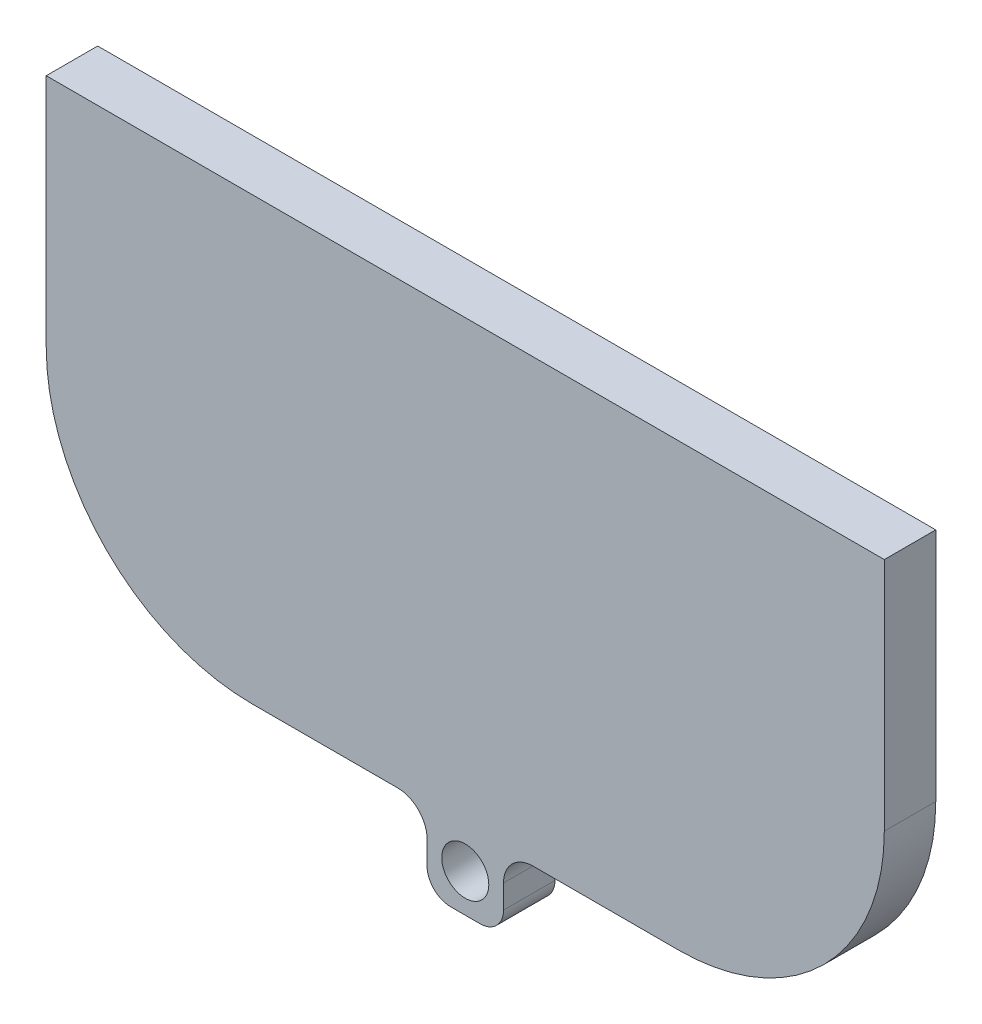
ISO-10303-21;
HEADER;
FILE_DESCRIPTION(('STEP AP214'),'2;1');
FILE_NAME('part.step','',(''),(''),'','','');
FILE_SCHEMA(('AUTOMOTIVE_DESIGN { 1 0 10303 214 1 1 1 1 }'));
ENDSEC;
DATA;
#1=APPLICATION_CONTEXT('core data for automotive mechanical design processes');
#2=APPLICATION_PROTOCOL_DEFINITION('international standard','automotive_design',2000,#1);
#3=PRODUCT_CONTEXT('',#1,'mechanical');
#4=PRODUCT('Part','Part','',(#3));
#5=PRODUCT_RELATED_PRODUCT_CATEGORY('part','',(#4));
#6=PRODUCT_DEFINITION_FORMATION('','',#4);
#7=PRODUCT_DEFINITION_CONTEXT('part definition',#1,'design');
#8=PRODUCT_DEFINITION('design','',#6,#7);
#9=PRODUCT_DEFINITION_SHAPE('','',#8);
#10=(LENGTH_UNIT() NAMED_UNIT(*) SI_UNIT(.MILLI.,.METRE.));
#11=(NAMED_UNIT(*) PLANE_ANGLE_UNIT() SI_UNIT($,.RADIAN.));
#12=(NAMED_UNIT(*) SI_UNIT($,.STERADIAN.) SOLID_ANGLE_UNIT());
#13=UNCERTAINTY_MEASURE_WITH_UNIT(LENGTH_MEASURE(1.E-05),#10,'distance_accuracy_value','');
#14=(GEOMETRIC_REPRESENTATION_CONTEXT(3) GLOBAL_UNCERTAINTY_ASSIGNED_CONTEXT((#13)) GLOBAL_UNIT_ASSIGNED_CONTEXT((#10,
#11,#12)) REPRESENTATION_CONTEXT('',''));
#15=CARTESIAN_POINT('',(0.,0.,0.));
#16=DIRECTION('',(0.,0.,1.));
#17=DIRECTION('',(1.,0.,0.));
#18=AXIS2_PLACEMENT_3D('',#15,#16,#17);
#19=CARTESIAN_POINT('',(-14.5,-30.,3.5));
#20=DIRECTION('',(0.,1.,0.));
#21=DIRECTION('',(-1.,0.,0.));
#22=AXIS2_PLACEMENT_3D('',#19,#20,#21);
#23=PLANE('',#22);
#24=DIRECTION('',(1.,0.,0.));
#25=VECTOR('',#24,1.);
#26=CARTESIAN_POINT('',(-14.5,-30.,3.5));
#27=LINE('',#26,#25);
#28=CARTESIAN_POINT('',(4.6,-30.,3.5));
#29=VERTEX_POINT('',#28);
#30=CARTESIAN_POINT('',(14.5,-30.,3.5));
#31=VERTEX_POINT('',#30);
#32=EDGE_CURVE('E232',#29,#31,#27,.T.);
#33=ORIENTED_EDGE('',*,*,#32,.F.);
#34=DIRECTION('',(0.,0.,1.));
#35=VECTOR('',#34,1.);
#36=CARTESIAN_POINT('',(4.6,-30.,0.));
#37=LINE('',#36,#35);
#38=CARTESIAN_POINT('',(4.6,-30.,0.));
#39=VERTEX_POINT('',#38);
#40=EDGE_CURVE('E82',#29,#39,#37,.F.);
#41=ORIENTED_EDGE('',*,*,#40,.T.);
#42=DIRECTION('',(1.,0.,0.));
#43=VECTOR('',#42,1.);
#44=CARTESIAN_POINT('',(-14.5,-30.,0.));
#45=LINE('',#44,#43);
#46=CARTESIAN_POINT('',(14.5,-30.,0.));
#47=VERTEX_POINT('',#46);
#48=EDGE_CURVE('E253',#39,#47,#45,.T.);
#49=ORIENTED_EDGE('',*,*,#48,.T.);
#50=DIRECTION('',(0.,0.,-1.));
#51=VECTOR('',#50,1.);
#52=CARTESIAN_POINT('',(14.5,-30.,3.5));
#53=LINE('',#52,#51);
#54=EDGE_CURVE('E263',#31,#47,#53,.T.);
#55=ORIENTED_EDGE('',*,*,#54,.F.);
#56=EDGE_LOOP('',(#33,#41,#49,#55));
#57=FACE_BOUND('',#56,.T.);
#58=ADVANCED_FACE('F60',(#57),#23,.F.);
#59=CARTESIAN_POINT('',(28.5,-16.,3.5));
#60=DIRECTION('',(-1.,0.,0.));
#61=DIRECTION('',(0.,-1.,0.));
#62=AXIS2_PLACEMENT_3D('',#59,#60,#61);
#63=PLANE('',#62);
#64=DIRECTION('',(0.,1.,0.));
#65=VECTOR('',#64,1.);
#66=CARTESIAN_POINT('',(28.5,-16.,0.));
#67=LINE('',#66,#65);
#68=CARTESIAN_POINT('',(28.5,-16.,0.));
#69=VERTEX_POINT('',#68);
#70=CARTESIAN_POINT('',(28.5,0.,0.));
#71=VERTEX_POINT('',#70);
#72=EDGE_CURVE('E218',#69,#71,#67,.T.);
#73=ORIENTED_EDGE('',*,*,#72,.T.);
#74=DIRECTION('',(0.,0.,-1.));
#75=VECTOR('',#74,1.);
#76=CARTESIAN_POINT('',(28.5,0.,3.5));
#77=LINE('',#76,#75);
#78=CARTESIAN_POINT('',(28.5,0.,3.5));
#79=VERTEX_POINT('',#78);
#80=EDGE_CURVE('E279',#79,#71,#77,.T.);
#81=ORIENTED_EDGE('',*,*,#80,.F.);
#82=DIRECTION('',(0.,1.,0.));
#83=VECTOR('',#82,1.);
#84=CARTESIAN_POINT('',(28.5,-16.,3.5));
#85=LINE('',#84,#83);
#86=CARTESIAN_POINT('',(28.5,-16.,3.5));
#87=VERTEX_POINT('',#86);
#88=EDGE_CURVE('E219',#87,#79,#85,.T.);
#89=ORIENTED_EDGE('',*,*,#88,.F.);
#90=DIRECTION('',(0.,0.,-1.));
#91=VECTOR('',#90,1.);
#92=CARTESIAN_POINT('',(28.5,-16.,3.5));
#93=LINE('',#92,#91);
#94=EDGE_CURVE('E240',#87,#69,#93,.T.);
#95=ORIENTED_EDGE('',*,*,#94,.T.);
#96=EDGE_LOOP('',(#73,#81,#89,#95));
#97=FACE_BOUND('',#96,.T.);
#98=ADVANCED_FACE('F333',(#97),#63,.F.);
#99=CARTESIAN_POINT('',(-24.5,0.,3.5));
#100=DIRECTION('',(0.,-1.,0.));
#101=DIRECTION('',(0.,0.,-1.));
#102=AXIS2_PLACEMENT_3D('',#99,#100,#101);
#103=PLANE('',#102);
#104=DIRECTION('',(-1.,0.,0.));
#105=VECTOR('',#104,1.);
#106=CARTESIAN_POINT('',(-24.5,0.,0.));
#107=LINE('',#106,#105);
#108=CARTESIAN_POINT('',(-28.5,0.,0.));
#109=VERTEX_POINT('',#108);
#110=EDGE_CURVE('E244',#71,#109,#107,.T.);
#111=ORIENTED_EDGE('',*,*,#110,.T.);
#112=DIRECTION('',(0.,0.,-1.));
#113=VECTOR('',#112,1.);
#114=CARTESIAN_POINT('',(-28.5,0.,3.5));
#115=LINE('',#114,#113);
#116=CARTESIAN_POINT('',(-28.5,0.,3.5));
#117=VERTEX_POINT('',#116);
#118=EDGE_CURVE('E275',#117,#109,#115,.T.);
#119=ORIENTED_EDGE('',*,*,#118,.F.);
#120=DIRECTION('',(-1.,0.,0.));
#121=VECTOR('',#120,1.);
#122=CARTESIAN_POINT('',(28.5,0.,3.5));
#123=LINE('',#122,#121);
#124=EDGE_CURVE('E222',#79,#117,#123,.T.);
#125=ORIENTED_EDGE('',*,*,#124,.F.);
#126=ORIENTED_EDGE('',*,*,#80,.T.);
#127=EDGE_LOOP('',(#111,#119,#125,#126));
#128=FACE_BOUND('',#127,.T.);
#129=ADVANCED_FACE('F335',(#128),#103,.F.);
#130=CARTESIAN_POINT('',(-28.5,0.,3.5));
#131=DIRECTION('',(1.,0.,0.));
#132=DIRECTION('',(0.,0.,-1.));
#133=AXIS2_PLACEMENT_3D('',#130,#131,#132);
#134=PLANE('',#133);
#135=DIRECTION('',(0.,-1.,0.));
#136=VECTOR('',#135,1.);
#137=CARTESIAN_POINT('',(-28.5,0.,0.));
#138=LINE('',#137,#136);
#139=CARTESIAN_POINT('',(-28.5,-16.,0.));
#140=VERTEX_POINT('',#139);
#141=EDGE_CURVE('E247',#109,#140,#138,.T.);
#142=ORIENTED_EDGE('',*,*,#141,.T.);
#143=DIRECTION('',(0.,0.,-1.));
#144=VECTOR('',#143,1.);
#145=CARTESIAN_POINT('',(-28.5,-16.,3.5));
#146=LINE('',#145,#144);
#147=CARTESIAN_POINT('',(-28.5,-16.,3.5));
#148=VERTEX_POINT('',#147);
#149=EDGE_CURVE('E271',#148,#140,#146,.T.);
#150=ORIENTED_EDGE('',*,*,#149,.F.);
#151=DIRECTION('',(0.,-1.,0.));
#152=VECTOR('',#151,1.);
#153=CARTESIAN_POINT('',(-28.5,0.,3.5));
#154=LINE('',#153,#152);
#155=EDGE_CURVE('E226',#117,#148,#154,.T.);
#156=ORIENTED_EDGE('',*,*,#155,.F.);
#157=ORIENTED_EDGE('',*,*,#118,.T.);
#158=EDGE_LOOP('',(#142,#150,#156,#157));
#159=FACE_BOUND('',#158,.T.);
#160=ADVANCED_FACE('F340',(#159),#134,.F.);
#161=CARTESIAN_POINT('',(-14.5,-16.,3.5));
#162=DIRECTION('',(0.,0.,-1.));
#163=DIRECTION('',(-1.,0.,0.));
#164=AXIS2_PLACEMENT_3D('',#161,#162,#163);
#165=CYLINDRICAL_SURFACE('',#164,14.);
#166=CARTESIAN_POINT('',(-14.5,-16.,0.));
#167=DIRECTION('',(0.,0.,1.));
#168=DIRECTION('',(1.,0.,0.));
#169=AXIS2_PLACEMENT_3D('',#166,#167,#168);
#170=CIRCLE('',#169,14.);
#171=CARTESIAN_POINT('',(-14.5,-30.,0.));
#172=VERTEX_POINT('',#171);
#173=EDGE_CURVE('E250',#140,#172,#170,.T.);
#174=ORIENTED_EDGE('',*,*,#173,.T.);
#175=DIRECTION('',(0.,0.,-1.));
#176=VECTOR('',#175,1.);
#177=CARTESIAN_POINT('',(-14.5,-30.,3.5));
#178=LINE('',#177,#176);
#179=CARTESIAN_POINT('',(-14.5,-30.,3.5));
#180=VERTEX_POINT('',#179);
#181=EDGE_CURVE('E267',#180,#172,#178,.T.);
#182=ORIENTED_EDGE('',*,*,#181,.F.);
#183=CARTESIAN_POINT('',(-14.5,-16.,3.5));
#184=DIRECTION('',(0.,0.,1.));
#185=DIRECTION('',(1.,0.,0.));
#186=AXIS2_PLACEMENT_3D('',#183,#184,#185);
#187=CIRCLE('',#186,14.);
#188=EDGE_CURVE('E229',#148,#180,#187,.T.);
#189=ORIENTED_EDGE('',*,*,#188,.F.);
#190=ORIENTED_EDGE('',*,*,#149,.T.);
#191=EDGE_LOOP('',(#174,#182,#189,#190));
#192=FACE_BOUND('',#191,.T.);
#193=ADVANCED_FACE('F345',(#192),#165,.T.);
#194=CARTESIAN_POINT('',(-4.6,-30.,0.));
#195=VERTEX_POINT('',#194);
#196=EDGE_CURVE('E254',#172,#195,#45,.T.);
#197=ORIENTED_EDGE('',*,*,#196,.T.);
#198=DIRECTION('',(0.,0.,1.));
#199=VECTOR('',#198,1.);
#200=CARTESIAN_POINT('',(-4.6,-30.,3.5));
#201=LINE('',#200,#199);
#202=CARTESIAN_POINT('',(-4.6,-30.,3.5));
#203=VERTEX_POINT('',#202);
#204=EDGE_CURVE('E283',#195,#203,#201,.T.);
#205=ORIENTED_EDGE('',*,*,#204,.T.);
#206=EDGE_CURVE('E233',#180,#203,#27,.T.);
#207=ORIENTED_EDGE('',*,*,#206,.F.);
#208=ORIENTED_EDGE('',*,*,#181,.T.);
#209=EDGE_LOOP('',(#197,#205,#207,#208));
#210=FACE_BOUND('',#209,.T.);
#211=ADVANCED_FACE('F349',(#210),#23,.F.);
#212=CARTESIAN_POINT('',(14.5,-16.,3.5));
#213=DIRECTION('',(0.,0.,-1.));
#214=DIRECTION('',(-1.,0.,0.));
#215=AXIS2_PLACEMENT_3D('',#212,#213,#214);
#216=CYLINDRICAL_SURFACE('',#215,14.);
#217=CARTESIAN_POINT('',(14.5,-16.,0.));
#218=DIRECTION('',(0.,0.,1.));
#219=DIRECTION('',(1.,0.,0.));
#220=AXIS2_PLACEMENT_3D('',#217,#218,#219);
#221=CIRCLE('',#220,14.);
#222=EDGE_CURVE('E223',#47,#69,#221,.T.);
#223=ORIENTED_EDGE('',*,*,#222,.T.);
#224=ORIENTED_EDGE('',*,*,#94,.F.);
#225=CARTESIAN_POINT('',(14.5,-16.,3.5));
#226=DIRECTION('',(0.,0.,1.));
#227=DIRECTION('',(1.,0.,0.));
#228=AXIS2_PLACEMENT_3D('',#225,#226,#227);
#229=CIRCLE('',#228,14.);
#230=EDGE_CURVE('E237',#31,#87,#229,.T.);
#231=ORIENTED_EDGE('',*,*,#230,.F.);
#232=ORIENTED_EDGE('',*,*,#54,.T.);
#233=EDGE_LOOP('',(#223,#224,#231,#232));
#234=FACE_BOUND('',#233,.T.);
#235=ADVANCED_FACE('F327',(#234),#216,.T.);
#236=CARTESIAN_POINT('',(-14.5,-16.,3.5));
#237=DIRECTION('',(0.,0.,1.));
#238=DIRECTION('',(1.,0.,0.));
#239=AXIS2_PLACEMENT_3D('',#236,#237,#238);
#240=PLANE('',#239);
#241=ORIENTED_EDGE('',*,*,#88,.T.);
#242=ORIENTED_EDGE('',*,*,#124,.T.);
#243=ORIENTED_EDGE('',*,*,#155,.T.);
#244=ORIENTED_EDGE('',*,*,#188,.T.);
#245=ORIENTED_EDGE('',*,*,#206,.T.);
#246=CARTESIAN_POINT('',(-4.6,-32.,3.5));
#247=DIRECTION('',(0.,0.,1.));
#248=DIRECTION('',(1.,0.,0.));
#249=AXIS2_PLACEMENT_3D('',#246,#247,#248);
#250=CIRCLE('',#249,2.);
#251=CARTESIAN_POINT('',(-2.6,-32.,3.5));
#252=VERTEX_POINT('',#251);
#253=EDGE_CURVE('E294',#203,#252,#250,.F.);
#254=ORIENTED_EDGE('',*,*,#253,.T.);
#255=DIRECTION('',(0.,-1.,0.));
#256=VECTOR('',#255,1.);
#257=CARTESIAN_POINT('',(-2.6,-30.,3.5));
#258=LINE('',#257,#256);
#259=CARTESIAN_POINT('',(-2.6,-33.6,3.5));
#260=VERTEX_POINT('',#259);
#261=EDGE_CURVE('E169',#252,#260,#258,.T.);
#262=ORIENTED_EDGE('',*,*,#261,.T.);
#263=CARTESIAN_POINT('',(-0.999999999999999,-33.6,3.5));
#264=DIRECTION('',(0.,0.,-1.));
#265=DIRECTION('',(-1.,0.,0.));
#266=AXIS2_PLACEMENT_3D('',#263,#264,#265);
#267=CIRCLE('',#266,1.6);
#268=CARTESIAN_POINT('',(-0.999999999999999,-35.2,3.5));
#269=VERTEX_POINT('',#268);
#270=EDGE_CURVE('E198',#269,#260,#267,.T.);
#271=ORIENTED_EDGE('',*,*,#270,.F.);
#272=DIRECTION('',(-1.,0.,0.));
#273=VECTOR('',#272,1.);
#274=CARTESIAN_POINT('',(1.,-35.2,3.5));
#275=LINE('',#274,#273);
#276=CARTESIAN_POINT('',(1.,-35.2,3.5));
#277=VERTEX_POINT('',#276);
#278=EDGE_CURVE('E180',#277,#269,#275,.T.);
#279=ORIENTED_EDGE('',*,*,#278,.F.);
#280=CARTESIAN_POINT('',(1.,-33.6,3.5));
#281=DIRECTION('',(0.,0.,1.));
#282=DIRECTION('',(1.,0.,0.));
#283=AXIS2_PLACEMENT_3D('',#280,#281,#282);
#284=CIRCLE('',#283,1.6);
#285=CARTESIAN_POINT('',(2.6,-33.6,3.5));
#286=VERTEX_POINT('',#285);
#287=EDGE_CURVE('E170',#277,#286,#284,.T.);
#288=ORIENTED_EDGE('',*,*,#287,.T.);
#289=DIRECTION('',(0.,-1.,0.));
#290=VECTOR('',#289,1.);
#291=CARTESIAN_POINT('',(2.6,-30.,3.5));
#292=LINE('',#291,#290);
#293=CARTESIAN_POINT('',(2.6,-32.,3.5));
#294=VERTEX_POINT('',#293);
#295=EDGE_CURVE('E160',#294,#286,#292,.T.);
#296=ORIENTED_EDGE('',*,*,#295,.F.);
#297=CARTESIAN_POINT('',(4.6,-32.,3.5));
#298=DIRECTION('',(0.,0.,1.));
#299=DIRECTION('',(1.,0.,0.));
#300=AXIS2_PLACEMENT_3D('',#297,#298,#299);
#301=CIRCLE('',#300,2.);
#302=EDGE_CURVE('E69',#294,#29,#301,.F.);
#303=ORIENTED_EDGE('',*,*,#302,.T.);
#304=ORIENTED_EDGE('',*,*,#32,.T.);
#305=ORIENTED_EDGE('',*,*,#230,.T.);
#306=EDGE_LOOP('',(#241,#242,#243,#244,#245,#254,#262,#271,#279,#288,#296,#303,#304,#305));
#307=FACE_BOUND('',#306,.T.);
#308=CARTESIAN_POINT('',(0.,-32.6,3.5));
#309=DIRECTION('',(0.,0.,1.));
#310=DIRECTION('',(1.,0.,0.));
#311=AXIS2_PLACEMENT_3D('',#308,#309,#310);
#312=CIRCLE('',#311,1.59999999999999);
#313=CARTESIAN_POINT('',(1.59999999999999,-32.6,3.5));
#314=VERTEX_POINT('',#313);
#315=EDGE_CURVE('E189',#314,#314,#312,.T.);
#316=ORIENTED_EDGE('',*,*,#315,.F.);
#317=EDGE_LOOP('',(#316));
#318=FACE_BOUND('',#317,.T.);
#319=ADVANCED_FACE('F184',(#307,#318),#240,.T.);
#320=CARTESIAN_POINT('',(-14.5,-16.,0.));
#321=DIRECTION('',(0.,0.,1.));
#322=DIRECTION('',(1.,0.,0.));
#323=AXIS2_PLACEMENT_3D('',#320,#321,#322);
#324=PLANE('',#323);
#325=ORIENTED_EDGE('',*,*,#72,.F.);
#326=ORIENTED_EDGE('',*,*,#222,.F.);
#327=ORIENTED_EDGE('',*,*,#48,.F.);
#328=CARTESIAN_POINT('',(4.6,-32.,0.));
#329=DIRECTION('',(0.,0.,1.));
#330=DIRECTION('',(1.,0.,0.));
#331=AXIS2_PLACEMENT_3D('',#328,#329,#330);
#332=CIRCLE('',#331,2.);
#333=CARTESIAN_POINT('',(2.6,-32.,0.));
#334=VERTEX_POINT('',#333);
#335=EDGE_CURVE('E12',#39,#334,#332,.T.);
#336=ORIENTED_EDGE('',*,*,#335,.T.);
#337=DIRECTION('',(0.,1.,0.));
#338=VECTOR('',#337,1.);
#339=CARTESIAN_POINT('',(2.6,-30.,0.));
#340=LINE('',#339,#338);
#341=CARTESIAN_POINT('',(2.6,-33.6,0.));
#342=VERTEX_POINT('',#341);
#343=EDGE_CURVE('E207',#342,#334,#340,.T.);
#344=ORIENTED_EDGE('',*,*,#343,.F.);
#345=CARTESIAN_POINT('',(1.,-33.6,0.));
#346=DIRECTION('',(0.,0.,1.));
#347=DIRECTION('',(1.,0.,0.));
#348=AXIS2_PLACEMENT_3D('',#345,#346,#347);
#349=CIRCLE('',#348,1.6);
#350=CARTESIAN_POINT('',(1.,-35.2,0.));
#351=VERTEX_POINT('',#350);
#352=EDGE_CURVE('E177',#342,#351,#349,.F.);
#353=ORIENTED_EDGE('',*,*,#352,.T.);
#354=DIRECTION('',(1.,0.,0.));
#355=VECTOR('',#354,1.);
#356=CARTESIAN_POINT('',(1.,-35.2,0.));
#357=LINE('',#356,#355);
#358=CARTESIAN_POINT('',(-0.999999999999999,-35.2,0.));
#359=VERTEX_POINT('',#358);
#360=EDGE_CURVE('E304',#359,#351,#357,.T.);
#361=ORIENTED_EDGE('',*,*,#360,.F.);
#362=CARTESIAN_POINT('',(-0.999999999999999,-33.6,0.));
#363=DIRECTION('',(0.,0.,1.));
#364=DIRECTION('',(1.,0.,0.));
#365=AXIS2_PLACEMENT_3D('',#362,#363,#364);
#366=CIRCLE('',#365,1.6);
#367=CARTESIAN_POINT('',(-2.6,-33.6,0.));
#368=VERTEX_POINT('',#367);
#369=EDGE_CURVE('E307',#368,#359,#366,.T.);
#370=ORIENTED_EDGE('',*,*,#369,.F.);
#371=DIRECTION('',(0.,1.,0.));
#372=VECTOR('',#371,1.);
#373=CARTESIAN_POINT('',(-2.6,-30.,0.));
#374=LINE('',#373,#372);
#375=CARTESIAN_POINT('',(-2.6,-32.,0.));
#376=VERTEX_POINT('',#375);
#377=EDGE_CURVE('E311',#368,#376,#374,.T.);
#378=ORIENTED_EDGE('',*,*,#377,.T.);
#379=CARTESIAN_POINT('',(-4.6,-32.,0.));
#380=DIRECTION('',(0.,0.,1.));
#381=DIRECTION('',(1.,0.,0.));
#382=AXIS2_PLACEMENT_3D('',#379,#380,#381);
#383=CIRCLE('',#382,2.);
#384=EDGE_CURVE('E297',#376,#195,#383,.T.);
#385=ORIENTED_EDGE('',*,*,#384,.T.);
#386=ORIENTED_EDGE('',*,*,#196,.F.);
#387=ORIENTED_EDGE('',*,*,#173,.F.);
#388=ORIENTED_EDGE('',*,*,#141,.F.);
#389=ORIENTED_EDGE('',*,*,#110,.F.);
#390=EDGE_LOOP('',(#325,#326,#327,#336,#344,#353,#361,#370,#378,#385,#386,#387,#388,#389));
#391=FACE_BOUND('',#390,.T.);
#392=CARTESIAN_POINT('',(0.,-32.6,0.));
#393=DIRECTION('',(0.,0.,1.));
#394=DIRECTION('',(1.,0.,0.));
#395=AXIS2_PLACEMENT_3D('',#392,#393,#394);
#396=CIRCLE('',#395,1.59999999999999);
#397=CARTESIAN_POINT('',(1.59999999999999,-32.6,0.));
#398=VERTEX_POINT('',#397);
#399=EDGE_CURVE('E214',#398,#398,#396,.F.);
#400=ORIENTED_EDGE('',*,*,#399,.F.);
#401=EDGE_LOOP('',(#400));
#402=FACE_BOUND('',#401,.T.);
#403=ADVANCED_FACE('F321',(#391,#402),#324,.F.);
#404=CARTESIAN_POINT('',(2.6,-30.,-7.35391052434009));
#405=DIRECTION('',(-1.,0.,0.));
#406=DIRECTION('',(0.,-1.,0.));
#407=AXIS2_PLACEMENT_3D('',#404,#405,#406);
#408=PLANE('',#407);
#409=ORIENTED_EDGE('',*,*,#343,.T.);
#410=DIRECTION('',(0.,0.,1.));
#411=VECTOR('',#410,1.);
#412=CARTESIAN_POINT('',(2.6,-32.,3.5));
#413=LINE('',#412,#411);
#414=EDGE_CURVE('E166',#334,#294,#413,.T.);
#415=ORIENTED_EDGE('',*,*,#414,.T.);
#416=ORIENTED_EDGE('',*,*,#295,.T.);
#417=DIRECTION('',(0.,0.,1.));
#418=VECTOR('',#417,1.);
#419=CARTESIAN_POINT('',(2.6,-33.6,-7.35391052434009));
#420=LINE('',#419,#418);
#421=EDGE_CURVE('E164',#342,#286,#420,.T.);
#422=ORIENTED_EDGE('',*,*,#421,.F.);
#423=EDGE_LOOP('',(#409,#415,#416,#422));
#424=FACE_BOUND('',#423,.T.);
#425=ADVANCED_FACE('F163',(#424),#408,.F.);
#426=CARTESIAN_POINT('',(-2.6,-30.,-7.35391052434009));
#427=DIRECTION('',(-1.,0.,0.));
#428=DIRECTION('',(0.,-1.,0.));
#429=AXIS2_PLACEMENT_3D('',#426,#427,#428);
#430=PLANE('',#429);
#431=ORIENTED_EDGE('',*,*,#261,.F.);
#432=DIRECTION('',(0.,0.,1.));
#433=VECTOR('',#432,1.);
#434=CARTESIAN_POINT('',(-2.6,-32.,-7.35391052434009));
#435=LINE('',#434,#433);
#436=EDGE_CURVE('E287',#252,#376,#435,.F.);
#437=ORIENTED_EDGE('',*,*,#436,.T.);
#438=ORIENTED_EDGE('',*,*,#377,.F.);
#439=DIRECTION('',(0.,0.,1.));
#440=VECTOR('',#439,1.);
#441=CARTESIAN_POINT('',(-2.6,-33.6,-7.35391052434009));
#442=LINE('',#441,#440);
#443=EDGE_CURVE('E179',#368,#260,#442,.T.);
#444=ORIENTED_EDGE('',*,*,#443,.T.);
#445=EDGE_LOOP('',(#431,#437,#438,#444));
#446=FACE_BOUND('',#445,.T.);
#447=ADVANCED_FACE('F357',(#446),#430,.T.);
#448=CARTESIAN_POINT('',(-0.999999999999999,-33.6,-7.35391052434009));
#449=DIRECTION('',(0.,0.,1.));
#450=DIRECTION('',(1.,0.,0.));
#451=AXIS2_PLACEMENT_3D('',#448,#449,#450);
#452=CYLINDRICAL_SURFACE('',#451,1.6);
#453=ORIENTED_EDGE('',*,*,#443,.F.);
#454=ORIENTED_EDGE('',*,*,#369,.T.);
#455=DIRECTION('',(0.,0.,1.));
#456=VECTOR('',#455,1.);
#457=CARTESIAN_POINT('',(-0.999999999999999,-35.2,-7.35391052434009));
#458=LINE('',#457,#456);
#459=EDGE_CURVE('E208',#359,#269,#458,.T.);
#460=ORIENTED_EDGE('',*,*,#459,.T.);
#461=ORIENTED_EDGE('',*,*,#270,.T.);
#462=EDGE_LOOP('',(#453,#454,#460,#461));
#463=FACE_BOUND('',#462,.T.);
#464=ADVANCED_FACE('F361',(#463),#452,.T.);
#465=CARTESIAN_POINT('',(1.,-35.2,-7.35391052434009));
#466=DIRECTION('',(0.,1.,0.));
#467=DIRECTION('',(0.,0.,1.));
#468=AXIS2_PLACEMENT_3D('',#465,#466,#467);
#469=PLANE('',#468);
#470=ORIENTED_EDGE('',*,*,#459,.F.);
#471=ORIENTED_EDGE('',*,*,#360,.T.);
#472=DIRECTION('',(0.,0.,1.));
#473=VECTOR('',#472,1.);
#474=CARTESIAN_POINT('',(1.,-35.2,-7.35391052434009));
#475=LINE('',#474,#473);
#476=EDGE_CURVE('E204',#351,#277,#475,.T.);
#477=ORIENTED_EDGE('',*,*,#476,.T.);
#478=ORIENTED_EDGE('',*,*,#278,.T.);
#479=EDGE_LOOP('',(#470,#471,#477,#478));
#480=FACE_BOUND('',#479,.T.);
#481=ADVANCED_FACE('F364',(#480),#469,.F.);
#482=CARTESIAN_POINT('',(1.,-33.6,-7.35391052434009));
#483=DIRECTION('',(0.,0.,1.));
#484=DIRECTION('',(1.,0.,0.));
#485=AXIS2_PLACEMENT_3D('',#482,#483,#484);
#486=CYLINDRICAL_SURFACE('',#485,1.6);
#487=ORIENTED_EDGE('',*,*,#352,.F.);
#488=ORIENTED_EDGE('',*,*,#421,.T.);
#489=ORIENTED_EDGE('',*,*,#287,.F.);
#490=ORIENTED_EDGE('',*,*,#476,.F.);
#491=EDGE_LOOP('',(#487,#488,#489,#490));
#492=FACE_BOUND('',#491,.T.);
#493=ADVANCED_FACE('F175',(#492),#486,.T.);
#494=CARTESIAN_POINT('',(0.,-32.6,-7.35391052434009));
#495=DIRECTION('',(0.,0.,1.));
#496=DIRECTION('',(1.,0.,0.));
#497=AXIS2_PLACEMENT_3D('',#494,#495,#496);
#498=CYLINDRICAL_SURFACE('',#497,1.59999999999999);
#499=ORIENTED_EDGE('',*,*,#399,.T.);
#500=EDGE_LOOP('',(#499));
#501=FACE_BOUND('',#500,.T.);
#502=ORIENTED_EDGE('',*,*,#315,.T.);
#503=EDGE_LOOP('',(#502));
#504=FACE_BOUND('',#503,.T.);
#505=ADVANCED_FACE('F371',(#501,#504),#498,.F.);
#506=CARTESIAN_POINT('',(-4.6,-32.,3.5));
#507=DIRECTION('',(0.,0.,1.));
#508=DIRECTION('',(1.,0.,0.));
#509=AXIS2_PLACEMENT_3D('',#506,#507,#508);
#510=CYLINDRICAL_SURFACE('',#509,2.);
#511=ORIENTED_EDGE('',*,*,#384,.F.);
#512=ORIENTED_EDGE('',*,*,#436,.F.);
#513=ORIENTED_EDGE('',*,*,#253,.F.);
#514=ORIENTED_EDGE('',*,*,#204,.F.);
#515=EDGE_LOOP('',(#511,#512,#513,#514));
#516=FACE_BOUND('',#515,.T.);
#517=ADVANCED_FACE('F353',(#516),#510,.F.);
#518=CARTESIAN_POINT('',(4.6,-32.,-7.35391052434009));
#519=DIRECTION('',(0.,0.,-1.));
#520=DIRECTION('',(-1.,0.,0.));
#521=AXIS2_PLACEMENT_3D('',#518,#519,#520);
#522=CYLINDRICAL_SURFACE('',#521,2.);
#523=ORIENTED_EDGE('',*,*,#335,.F.);
#524=ORIENTED_EDGE('',*,*,#40,.F.);
#525=ORIENTED_EDGE('',*,*,#302,.F.);
#526=ORIENTED_EDGE('',*,*,#414,.F.);
#527=EDGE_LOOP('',(#523,#524,#525,#526));
#528=FACE_BOUND('',#527,.T.);
#529=ADVANCED_FACE('F62',(#528),#522,.F.);
#530=CLOSED_SHELL('',(#58,#98,#129,#160,#193,#211,#235,#319,#403,#425,#447,#464,#481,#493,#505,
#517,#529));
#531=MANIFOLD_SOLID_BREP('B2',#530);
#532=ADVANCED_BREP_SHAPE_REPRESENTATION('',(#18,#531),#14);
#533=SHAPE_DEFINITION_REPRESENTATION(#9,#532);
ENDSEC;
END-ISO-10303-21;
